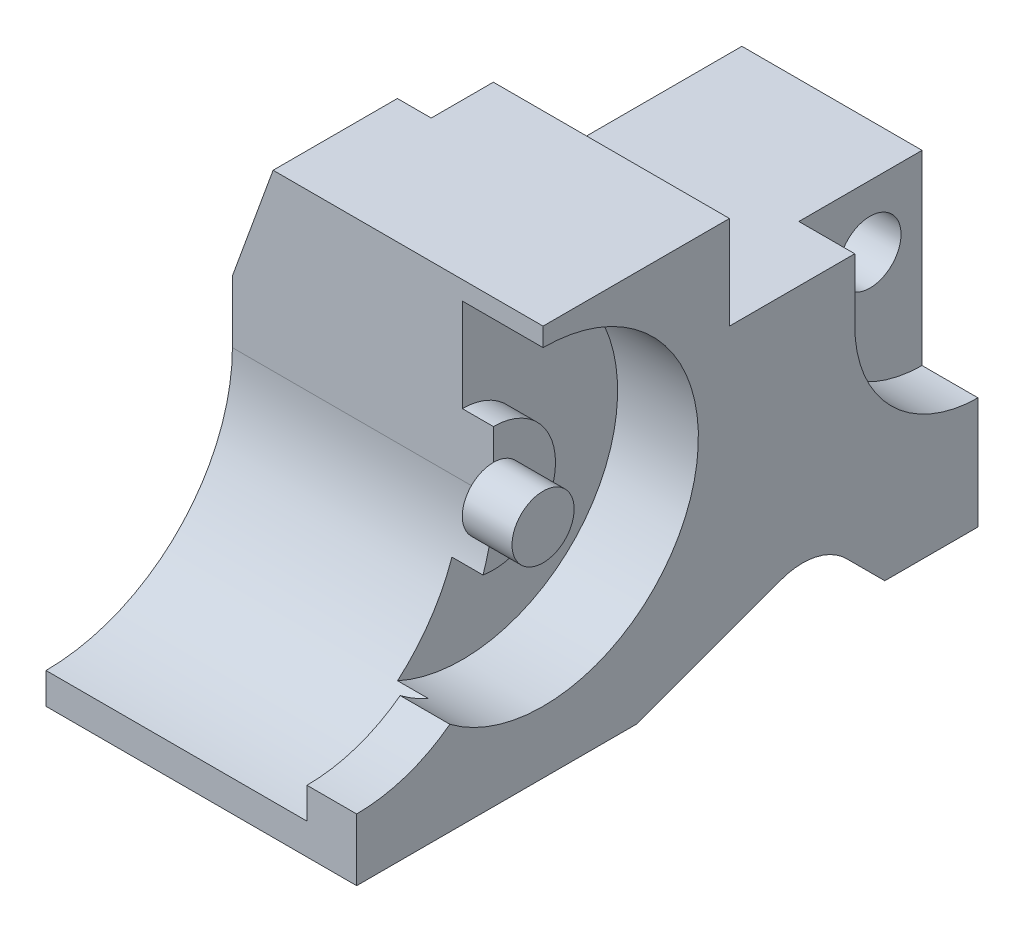
ISO-10303-21;
HEADER;
FILE_DESCRIPTION(('STEP AP214'),'2;1');
FILE_NAME('part.step','',(''),(''),'','','');
FILE_SCHEMA(('AUTOMOTIVE_DESIGN { 1 0 10303 214 1 1 1 1 }'));
ENDSEC;
DATA;
#1=APPLICATION_CONTEXT('core data for automotive mechanical design processes');
#2=APPLICATION_PROTOCOL_DEFINITION('international standard','automotive_design',2000,#1);
#3=PRODUCT_CONTEXT('',#1,'mechanical');
#4=PRODUCT('Part','Part','',(#3));
#5=PRODUCT_RELATED_PRODUCT_CATEGORY('part','',(#4));
#6=PRODUCT_DEFINITION_FORMATION('','',#4);
#7=PRODUCT_DEFINITION_CONTEXT('part definition',#1,'design');
#8=PRODUCT_DEFINITION('design','',#6,#7);
#9=PRODUCT_DEFINITION_SHAPE('','',#8);
#10=(LENGTH_UNIT() NAMED_UNIT(*) SI_UNIT(.MILLI.,.METRE.));
#11=(NAMED_UNIT(*) PLANE_ANGLE_UNIT() SI_UNIT($,.RADIAN.));
#12=(NAMED_UNIT(*) SI_UNIT($,.STERADIAN.) SOLID_ANGLE_UNIT());
#13=UNCERTAINTY_MEASURE_WITH_UNIT(LENGTH_MEASURE(1.E-05),#10,'distance_accuracy_value','');
#14=(GEOMETRIC_REPRESENTATION_CONTEXT(3) GLOBAL_UNCERTAINTY_ASSIGNED_CONTEXT((#13)) GLOBAL_UNIT_ASSIGNED_CONTEXT((#10,
#11,#12)) REPRESENTATION_CONTEXT('',''));
#15=CARTESIAN_POINT('',(0.,0.,0.));
#16=DIRECTION('',(0.,0.,1.));
#17=DIRECTION('',(1.,0.,0.));
#18=AXIS2_PLACEMENT_3D('',#15,#16,#17);
#19=CARTESIAN_POINT('',(-50.,37.748490945674,43.3502422988636));
#20=DIRECTION('',(0.,0.,1.));
#21=DIRECTION('',(1.,0.,0.));
#22=AXIS2_PLACEMENT_3D('',#19,#20,#21);
#23=PLANE('',#22);
#24=DIRECTION('',(0.,-1.,0.));
#25=VECTOR('',#24,1.);
#26=CARTESIAN_POINT('',(0.,37.748490945674,43.3502422988636));
#27=LINE('',#26,#25);
#28=CARTESIAN_POINT('',(0.,-15.2515090543259,43.3502422988636));
#29=VERTEX_POINT('',#28);
#30=CARTESIAN_POINT('',(0.,-25.2515090543259,43.3502422988636));
#31=VERTEX_POINT('',#30);
#32=EDGE_CURVE('E245',#29,#31,#27,.T.);
#33=ORIENTED_EDGE('',*,*,#32,.F.);
#34=DIRECTION('',(1.,0.,0.));
#35=VECTOR('',#34,1.);
#36=CARTESIAN_POINT('',(-37.1547594742265,-15.2515090543259,43.3502422988636));
#37=LINE('',#36,#35);
#38=CARTESIAN_POINT('',(-8.,-15.2515090543259,43.3502422988636));
#39=VERTEX_POINT('',#38);
#40=EDGE_CURVE('E391',#39,#29,#37,.T.);
#41=ORIENTED_EDGE('',*,*,#40,.F.);
#42=DIRECTION('',(0.,1.,0.));
#43=VECTOR('',#42,1.);
#44=CARTESIAN_POINT('',(-8.,0.,43.3502422988636));
#45=LINE('',#44,#43);
#46=CARTESIAN_POINT('',(-8.,-20.2515090543259,43.3502422988636));
#47=VERTEX_POINT('',#46);
#48=EDGE_CURVE('E319',#47,#39,#45,.T.);
#49=ORIENTED_EDGE('',*,*,#48,.F.);
#50=DIRECTION('',(-1.,0.,0.));
#51=VECTOR('',#50,1.);
#52=CARTESIAN_POINT('',(-8.,-20.2515090543259,43.3502422988636));
#53=LINE('',#52,#51);
#54=CARTESIAN_POINT('',(-50.,-20.2515090543259,43.3502422988636));
#55=VERTEX_POINT('',#54);
#56=EDGE_CURVE('E316',#47,#55,#53,.T.);
#57=ORIENTED_EDGE('',*,*,#56,.T.);
#58=DIRECTION('',(0.,-1.,0.));
#59=VECTOR('',#58,1.);
#60=CARTESIAN_POINT('',(-50.,37.748490945674,43.3502422988636));
#61=LINE('',#60,#59);
#62=CARTESIAN_POINT('',(-50.,-25.2515090543259,43.3502422988636));
#63=VERTEX_POINT('',#62);
#64=EDGE_CURVE('E239',#55,#63,#61,.T.);
#65=ORIENTED_EDGE('',*,*,#64,.T.);
#66=DIRECTION('',(1.,0.,0.));
#67=VECTOR('',#66,1.);
#68=CARTESIAN_POINT('',(-50.,-25.2515090543259,43.3502422988636));
#69=LINE('',#68,#67);
#70=EDGE_CURVE('E229',#63,#31,#69,.T.);
#71=ORIENTED_EDGE('',*,*,#70,.T.);
#72=EDGE_LOOP('',(#33,#41,#49,#57,#65,#71));
#73=FACE_BOUND('',#72,.T.);
#74=ADVANCED_FACE('F38',(#73),#23,.T.);
#75=CARTESIAN_POINT('',(0.,0.,0.));
#76=DIRECTION('',(1.,0.,0.));
#77=DIRECTION('',(0.,0.,-1.));
#78=AXIS2_PLACEMENT_3D('',#75,#76,#77);
#79=PLANE('',#78);
#80=CARTESIAN_POINT('',(0.,9.74849094567405,13.3502422988636));
#81=DIRECTION('',(1.,0.,0.));
#82=DIRECTION('',(0.,0.,-1.));
#83=AXIS2_PLACEMENT_3D('',#80,#81,#82);
#84=CIRCLE('',#83,25.);
#85=CARTESIAN_POINT('',(0.,-10.2515090543259,28.3502422988636));
#86=VERTEX_POINT('',#85);
#87=CARTESIAN_POINT('',(0.,34.7484909456741,13.3502422988636));
#88=VERTEX_POINT('',#87);
#89=EDGE_CURVE('E358',#86,#88,#84,.T.);
#90=ORIENTED_EDGE('',*,*,#89,.F.);
#91=CARTESIAN_POINT('',(0.,9.74849094567405,43.3502422988636));
#92=DIRECTION('',(1.,0.,0.));
#93=DIRECTION('',(0.,0.,-1.));
#94=AXIS2_PLACEMENT_3D('',#91,#92,#93);
#95=CIRCLE('',#94,25.);
#96=EDGE_CURVE('E52',#86,#29,#95,.F.);
#97=ORIENTED_EDGE('',*,*,#96,.T.);
#98=ORIENTED_EDGE('',*,*,#32,.T.);
#99=DIRECTION('',(0.,0.,-1.));
#100=VECTOR('',#99,1.);
#101=CARTESIAN_POINT('',(0.,-25.2515090543259,43.3502422988636));
#102=LINE('',#101,#100);
#103=CARTESIAN_POINT('',(0.,-25.2515090543259,-1.64975770113641));
#104=VERTEX_POINT('',#103);
#105=EDGE_CURVE('E241',#31,#104,#102,.T.);
#106=ORIENTED_EDGE('',*,*,#105,.T.);
#107=DIRECTION('',(0.,-0.342020143325663,0.93969262078591));
#108=VECTOR('',#107,1.);
#109=CARTESIAN_POINT('',(0.,-16.756570836525,-24.9894086342069));
#110=LINE('',#109,#108);
#111=CARTESIAN_POINT('',(0.,-16.756570836525,-24.9894086342069));
#112=VERTEX_POINT('',#111);
#113=EDGE_CURVE('E306',#112,#104,#110,.T.);
#114=ORIENTED_EDGE('',*,*,#113,.F.);
#115=CARTESIAN_POINT('',(0.,-26.1534970443841,-28.4096100674636));
#116=DIRECTION('',(1.,0.,0.));
#117=DIRECTION('',(0.,0.,-1.));
#118=AXIS2_PLACEMENT_3D('',#115,#116,#117);
#119=CIRCLE('',#118,10.);
#120=CARTESIAN_POINT('',(0.,-19.0824292325186,-35.480677879329));
#121=VERTEX_POINT('',#120);
#122=EDGE_CURVE('E308',#121,#112,#119,.T.);
#123=ORIENTED_EDGE('',*,*,#122,.F.);
#124=DIRECTION('',(0.,0.707106781186544,0.707106781186551));
#125=VECTOR('',#124,1.);
#126=CARTESIAN_POINT('',(0.,-25.2515090543259,-41.6497577011364));
#127=LINE('',#126,#125);
#128=CARTESIAN_POINT('',(0.,-25.2515090543259,-41.6497577011364));
#129=VERTEX_POINT('',#128);
#130=EDGE_CURVE('E311',#129,#121,#127,.T.);
#131=ORIENTED_EDGE('',*,*,#130,.F.);
#132=CARTESIAN_POINT('',(0.,-25.2515090543259,-56.6497577011364));
#133=VERTEX_POINT('',#132);
#134=EDGE_CURVE('E244',#129,#133,#102,.T.);
#135=ORIENTED_EDGE('',*,*,#134,.T.);
#136=DIRECTION('',(0.,1.,0.));
#137=VECTOR('',#136,1.);
#138=CARTESIAN_POINT('',(0.,37.748490945674,-56.6497577011364));
#139=LINE('',#138,#137);
#140=CARTESIAN_POINT('',(0.,-7.25083423659062,-56.6497577011364));
#141=VERTEX_POINT('',#140);
#142=EDGE_CURVE('E228',#133,#141,#139,.T.);
#143=ORIENTED_EDGE('',*,*,#142,.T.);
#144=CARTESIAN_POINT('',(0.,12.7484909456741,-56.8140508964729));
#145=DIRECTION('',(1.,0.,0.));
#146=DIRECTION('',(0.,0.,-1.));
#147=AXIS2_PLACEMENT_3D('',#144,#145,#146);
#148=CIRCLE('',#147,20.);
#149=CARTESIAN_POINT('',(0.,12.748490945674,-36.8140508964729));
#150=VERTEX_POINT('',#149);
#151=EDGE_CURVE('E279',#150,#141,#148,.T.);
#152=ORIENTED_EDGE('',*,*,#151,.F.);
#153=DIRECTION('',(0.,-1.,0.));
#154=VECTOR('',#153,1.);
#155=CARTESIAN_POINT('',(0.,22.748490945674,-36.8140508964729));
#156=LINE('',#155,#154);
#157=CARTESIAN_POINT('',(0.,22.748490945674,-36.8140508964729));
#158=VERTEX_POINT('',#157);
#159=EDGE_CURVE('E282',#158,#150,#156,.T.);
#160=ORIENTED_EDGE('',*,*,#159,.F.);
#161=DIRECTION('',(0.,0.,-1.));
#162=VECTOR('',#161,1.);
#163=CARTESIAN_POINT('',(0.,22.748490945674,-56.6497577011364));
#164=LINE('',#163,#162);
#165=CARTESIAN_POINT('',(0.,22.748490945674,-16.6497577011364));
#166=VERTEX_POINT('',#165);
#167=EDGE_CURVE('E259',#166,#158,#164,.T.);
#168=ORIENTED_EDGE('',*,*,#167,.F.);
#169=DIRECTION('',(0.,1.,0.));
#170=VECTOR('',#169,1.);
#171=CARTESIAN_POINT('',(0.,22.748490945674,-16.6497577011364));
#172=LINE('',#171,#170);
#173=CARTESIAN_POINT('',(0.,37.748490945674,-16.6497577011364));
#174=VERTEX_POINT('',#173);
#175=EDGE_CURVE('E247',#166,#174,#172,.T.);
#176=ORIENTED_EDGE('',*,*,#175,.T.);
#177=DIRECTION('',(0.,0.,1.));
#178=VECTOR('',#177,1.);
#179=CARTESIAN_POINT('',(0.,37.748490945674,43.3502422988636));
#180=LINE('',#179,#178);
#181=CARTESIAN_POINT('',(0.,37.748490945674,13.3502422988636));
#182=VERTEX_POINT('',#181);
#183=EDGE_CURVE('E236',#174,#182,#180,.T.);
#184=ORIENTED_EDGE('',*,*,#183,.T.);
#185=DIRECTION('',(0.,1.,0.));
#186=VECTOR('',#185,1.);
#187=CARTESIAN_POINT('',(0.,0.,13.3502422988636));
#188=LINE('',#187,#186);
#189=EDGE_CURVE('E335',#88,#182,#188,.T.);
#190=ORIENTED_EDGE('',*,*,#189,.F.);
#191=EDGE_LOOP('',(#90,#97,#98,#106,#114,#123,#131,#135,#143,#152,#160,#168,#176,#184,#190));
#192=FACE_BOUND('',#191,.T.);
#193=ADVANCED_FACE('F429',(#192),#79,.T.);
#194=CARTESIAN_POINT('',(-8.,0.,0.));
#195=DIRECTION('',(-1.,0.,0.));
#196=DIRECTION('',(0.,0.,1.));
#197=AXIS2_PLACEMENT_3D('',#194,#195,#196);
#198=PLANE('',#197);
#199=ORIENTED_EDGE('',*,*,#48,.T.);
#200=CARTESIAN_POINT('',(-8.,9.74849094567405,43.3502422988636));
#201=DIRECTION('',(-1.,0.,0.));
#202=DIRECTION('',(0.,0.,1.));
#203=AXIS2_PLACEMENT_3D('',#200,#201,#202);
#204=CIRCLE('',#203,25.);
#205=CARTESIAN_POINT('',(-8.,-10.2515090543259,28.3502422988636));
#206=VERTEX_POINT('',#205);
#207=EDGE_CURVE('E387',#206,#39,#204,.T.);
#208=ORIENTED_EDGE('',*,*,#207,.F.);
#209=CARTESIAN_POINT('',(-8.,9.74849094567405,13.3502422988636));
#210=DIRECTION('',(-1.,0.,0.));
#211=DIRECTION('',(0.,0.,1.));
#212=AXIS2_PLACEMENT_3D('',#209,#210,#211);
#213=CIRCLE('',#212,25.);
#214=CARTESIAN_POINT('',(-8.,-12.9779926264837,23.7669089655303));
#215=VERTEX_POINT('',#214);
#216=EDGE_CURVE('E345',#215,#206,#213,.T.);
#217=ORIENTED_EDGE('',*,*,#216,.F.);
#218=CARTESIAN_POINT('',(-8.,9.74849094567405,43.3502422988636));
#219=DIRECTION('',(-1.,0.,0.));
#220=DIRECTION('',(0.,0.,1.));
#221=AXIS2_PLACEMENT_3D('',#218,#219,#220);
#222=CIRCLE('',#221,30.);
#223=EDGE_CURVE('E329',#47,#215,#222,.F.);
#224=ORIENTED_EDGE('',*,*,#223,.F.);
#225=EDGE_LOOP('',(#199,#208,#217,#224));
#226=FACE_BOUND('',#225,.T.);
#227=ADVANCED_FACE('F458',(#226),#198,.T.);
#228=CARTESIAN_POINT('',(-13.,9.74849094567405,13.3502422988636));
#229=DIRECTION('',(1.,0.,0.));
#230=DIRECTION('',(0.,0.,-1.));
#231=AXIS2_PLACEMENT_3D('',#228,#229,#230);
#232=CYLINDRICAL_SURFACE('',#231,25.);
#233=DIRECTION('',(1.,0.,0.));
#234=VECTOR('',#233,1.);
#235=CARTESIAN_POINT('',(-37.1547594742265,-10.2515090543259,28.3502422988636));
#236=LINE('',#235,#234);
#237=EDGE_CURVE('E388',#206,#86,#236,.T.);
#238=ORIENTED_EDGE('',*,*,#237,.T.);
#239=ORIENTED_EDGE('',*,*,#89,.T.);
#240=DIRECTION('',(1.,0.,0.));
#241=VECTOR('',#240,1.);
#242=CARTESIAN_POINT('',(-13.,34.7484909456741,13.3502422988636));
#243=LINE('',#242,#241);
#244=CARTESIAN_POINT('',(-13.,34.7484909456741,13.3502422988636));
#245=VERTEX_POINT('',#244);
#246=EDGE_CURVE('E352',#245,#88,#243,.T.);
#247=ORIENTED_EDGE('',*,*,#246,.F.);
#248=CARTESIAN_POINT('',(-13.,9.74849094567405,13.3502422988636));
#249=DIRECTION('',(1.,0.,0.));
#250=DIRECTION('',(0.,0.,-1.));
#251=AXIS2_PLACEMENT_3D('',#248,#249,#250);
#252=CIRCLE('',#251,25.);
#253=CARTESIAN_POINT('',(-13.,-12.9779926264837,23.7669089655303));
#254=VERTEX_POINT('',#253);
#255=EDGE_CURVE('E364',#254,#245,#252,.T.);
#256=ORIENTED_EDGE('',*,*,#255,.F.);
#257=DIRECTION('',(1.,0.,0.));
#258=VECTOR('',#257,1.);
#259=CARTESIAN_POINT('',(-6.5,-12.9779926264837,23.7669089655303));
#260=LINE('',#259,#258);
#261=EDGE_CURVE('E343',#254,#215,#260,.T.);
#262=ORIENTED_EDGE('',*,*,#261,.T.);
#263=ORIENTED_EDGE('',*,*,#216,.T.);
#264=EDGE_LOOP('',(#238,#239,#247,#256,#262,#263));
#265=FACE_BOUND('',#264,.T.);
#266=ADVANCED_FACE('F461',(#265),#232,.F.);
#267=CARTESIAN_POINT('',(0.,0.,13.3502422988636));
#268=DIRECTION('',(0.,0.,1.));
#269=DIRECTION('',(1.,0.,0.));
#270=AXIS2_PLACEMENT_3D('',#267,#268,#269);
#271=PLANE('',#270);
#272=DIRECTION('',(0.342020143325669,0.939692620785908,0.));
#273=VECTOR('',#272,1.);
#274=CARTESIAN_POINT('',(-50.,19.748490945674,13.3502422988636));
#275=LINE('',#274,#273);
#276=CARTESIAN_POINT('',(-50.,19.748490945674,13.3502422988636));
#277=VERTEX_POINT('',#276);
#278=CARTESIAN_POINT('',(-43.4485357832083,37.748490945674,13.3502422988636));
#279=VERTEX_POINT('',#278);
#280=EDGE_CURVE('E384',#277,#279,#275,.T.);
#281=ORIENTED_EDGE('',*,*,#280,.F.);
#282=DIRECTION('',(0.,1.,0.));
#283=VECTOR('',#282,1.);
#284=CARTESIAN_POINT('',(-50.,0.,13.3502422988636));
#285=LINE('',#284,#283);
#286=CARTESIAN_POINT('',(-50.,9.74849094567405,13.3502422988636));
#287=VERTEX_POINT('',#286);
#288=EDGE_CURVE('E336',#287,#277,#285,.T.);
#289=ORIENTED_EDGE('',*,*,#288,.F.);
#290=DIRECTION('',(-1.,0.,0.));
#291=VECTOR('',#290,1.);
#292=CARTESIAN_POINT('',(-8.,9.74849094567405,13.3502422988636));
#293=LINE('',#292,#291);
#294=CARTESIAN_POINT('',(-8.,9.74849094567405,13.3502422988636));
#295=VERTEX_POINT('',#294);
#296=EDGE_CURVE('E314',#295,#287,#293,.T.);
#297=ORIENTED_EDGE('',*,*,#296,.F.);
#298=DIRECTION('',(0.,-1.,0.));
#299=VECTOR('',#298,1.);
#300=CARTESIAN_POINT('',(-8.,0.,13.3502422988636));
#301=LINE('',#300,#299);
#302=CARTESIAN_POINT('',(-8.,14.7484909456741,13.3502422988636));
#303=VERTEX_POINT('',#302);
#304=EDGE_CURVE('E372',#303,#295,#301,.T.);
#305=ORIENTED_EDGE('',*,*,#304,.F.);
#306=DIRECTION('',(0.,-1.,0.));
#307=VECTOR('',#306,1.);
#308=CARTESIAN_POINT('',(-8.,0.,13.3502422988636));
#309=LINE('',#308,#307);
#310=CARTESIAN_POINT('',(-8.,19.7484909456741,13.3502422988636));
#311=VERTEX_POINT('',#310);
#312=EDGE_CURVE('E361',#311,#303,#309,.T.);
#313=ORIENTED_EDGE('',*,*,#312,.F.);
#314=DIRECTION('',(1.,0.,0.));
#315=VECTOR('',#314,1.);
#316=CARTESIAN_POINT('',(-13.,19.7484909456741,13.3502422988636));
#317=LINE('',#316,#315);
#318=CARTESIAN_POINT('',(-13.,19.7484909456741,13.3502422988636));
#319=VERTEX_POINT('',#318);
#320=EDGE_CURVE('E351',#319,#311,#317,.T.);
#321=ORIENTED_EDGE('',*,*,#320,.F.);
#322=DIRECTION('',(0.,-1.,0.));
#323=VECTOR('',#322,1.);
#324=CARTESIAN_POINT('',(-13.,0.,13.3502422988636));
#325=LINE('',#324,#323);
#326=EDGE_CURVE('E355',#245,#319,#325,.T.);
#327=ORIENTED_EDGE('',*,*,#326,.F.);
#328=ORIENTED_EDGE('',*,*,#246,.T.);
#329=ORIENTED_EDGE('',*,*,#189,.T.);
#330=DIRECTION('',(-1.,0.,0.));
#331=VECTOR('',#330,1.);
#332=CARTESIAN_POINT('',(0.,37.748490945674,13.3502422988636));
#333=LINE('',#332,#331);
#334=EDGE_CURVE('E326',#182,#279,#333,.T.);
#335=ORIENTED_EDGE('',*,*,#334,.T.);
#336=EDGE_LOOP('',(#281,#289,#297,#305,#313,#321,#327,#328,#329,#335));
#337=FACE_BOUND('',#336,.T.);
#338=ADVANCED_FACE('F419',(#337),#271,.T.);
#339=CARTESIAN_POINT('',(0.,9.74849094567405,13.3502422988636));
#340=DIRECTION('',(1.,0.,0.));
#341=DIRECTION('',(0.,0.,-1.));
#342=AXIS2_PLACEMENT_3D('',#339,#340,#341);
#343=CIRCLE('',#342,5.);
#344=CARTESIAN_POINT('',(0.,9.74849094567405,8.35024229886359));
#345=VERTEX_POINT('',#344);
#346=EDGE_CURVE('E368',#345,#345,#343,.T.);
#347=ORIENTED_EDGE('',*,*,#346,.T.);
#348=EDGE_LOOP('',(#347));
#349=FACE_BOUND('',#348,.T.);
#350=ADVANCED_FACE('F482',(#349),#79,.T.);
#351=CARTESIAN_POINT('',(-8.,4.76588230271514,13.7669089655303));
#352=VERTEX_POINT('',#351);
#353=EDGE_CURVE('E325',#352,#295,#222,.F.);
#354=ORIENTED_EDGE('',*,*,#353,.F.);
#355=CARTESIAN_POINT('',(-8.,9.74849094567405,13.3502422988636));
#356=DIRECTION('',(1.,0.,0.));
#357=DIRECTION('',(0.,0.,-1.));
#358=AXIS2_PLACEMENT_3D('',#355,#356,#357);
#359=CIRCLE('',#358,5.);
#360=EDGE_CURVE('E375',#303,#352,#359,.T.);
#361=ORIENTED_EDGE('',*,*,#360,.F.);
#362=ORIENTED_EDGE('',*,*,#304,.T.);
#363=EDGE_LOOP('',(#354,#361,#362));
#364=FACE_BOUND('',#363,.T.);
#365=ADVANCED_FACE('F480',(#364),#198,.T.);
#366=CARTESIAN_POINT('',(-13.,9.74849094567405,13.3502422988636));
#367=DIRECTION('',(1.,0.,0.));
#368=DIRECTION('',(0.,0.,-1.));
#369=AXIS2_PLACEMENT_3D('',#366,#367,#368);
#370=CYLINDRICAL_SURFACE('',#369,10.);
#371=ORIENTED_EDGE('',*,*,#320,.T.);
#372=CARTESIAN_POINT('',(-8.,9.74849094567405,13.3502422988636));
#373=DIRECTION('',(1.,0.,0.));
#374=DIRECTION('',(0.,0.,-1.));
#375=AXIS2_PLACEMENT_3D('',#372,#373,#374);
#376=CIRCLE('',#375,10.);
#377=CARTESIAN_POINT('',(-8.,-0.11164202615864,15.0169089655303));
#378=VERTEX_POINT('',#377);
#379=EDGE_CURVE('E45',#311,#378,#376,.F.);
#380=ORIENTED_EDGE('',*,*,#379,.T.);
#381=DIRECTION('',(1.,0.,0.));
#382=VECTOR('',#381,1.);
#383=CARTESIAN_POINT('',(-6.5,-0.111642026158643,15.0169089655303));
#384=LINE('',#383,#382);
#385=CARTESIAN_POINT('',(-13.,-0.111642026158642,15.0169089655303));
#386=VERTEX_POINT('',#385);
#387=EDGE_CURVE('E339',#386,#378,#384,.T.);
#388=ORIENTED_EDGE('',*,*,#387,.F.);
#389=CARTESIAN_POINT('',(-13.,9.74849094567405,13.3502422988636));
#390=DIRECTION('',(1.,0.,0.));
#391=DIRECTION('',(0.,0.,-1.));
#392=AXIS2_PLACEMENT_3D('',#389,#390,#391);
#393=CIRCLE('',#392,10.);
#394=EDGE_CURVE('E360',#386,#319,#393,.T.);
#395=ORIENTED_EDGE('',*,*,#394,.T.);
#396=EDGE_LOOP('',(#371,#380,#388,#395));
#397=FACE_BOUND('',#396,.T.);
#398=ADVANCED_FACE('F470',(#397),#370,.T.);
#399=CARTESIAN_POINT('',(-8.,9.74849094567405,43.3502422988636));
#400=DIRECTION('',(-1.,0.,0.));
#401=DIRECTION('',(0.,0.,1.));
#402=AXIS2_PLACEMENT_3D('',#399,#400,#401);
#403=CYLINDRICAL_SURFACE('',#402,30.);
#404=CARTESIAN_POINT('',(-13.,9.74849094567405,43.3502422988636));
#405=DIRECTION('',(1.,0.,0.));
#406=DIRECTION('',(0.,0.,-1.));
#407=AXIS2_PLACEMENT_3D('',#404,#405,#406);
#408=CIRCLE('',#407,30.);
#409=EDGE_CURVE('E348',#254,#386,#408,.T.);
#410=ORIENTED_EDGE('',*,*,#409,.T.);
#411=ORIENTED_EDGE('',*,*,#387,.T.);
#412=EDGE_CURVE('E332',#378,#352,#222,.F.);
#413=ORIENTED_EDGE('',*,*,#412,.T.);
#414=ORIENTED_EDGE('',*,*,#353,.T.);
#415=ORIENTED_EDGE('',*,*,#296,.T.);
#416=CARTESIAN_POINT('',(-50.,9.74849094567405,43.3502422988636));
#417=DIRECTION('',(-1.,0.,0.));
#418=DIRECTION('',(0.,0.,1.));
#419=AXIS2_PLACEMENT_3D('',#416,#417,#418);
#420=CIRCLE('',#419,30.);
#421=EDGE_CURVE('E322',#55,#287,#420,.F.);
#422=ORIENTED_EDGE('',*,*,#421,.F.);
#423=ORIENTED_EDGE('',*,*,#56,.F.);
#424=ORIENTED_EDGE('',*,*,#223,.T.);
#425=ORIENTED_EDGE('',*,*,#261,.F.);
#426=EDGE_LOOP('',(#410,#411,#413,#414,#415,#422,#423,#424,#425));
#427=FACE_BOUND('',#426,.T.);
#428=ADVANCED_FACE('F454',(#427),#403,.F.);
#429=CARTESIAN_POINT('',(-50.,0.,0.));
#430=DIRECTION('',(1.,0.,0.));
#431=DIRECTION('',(0.,0.,-1.));
#432=AXIS2_PLACEMENT_3D('',#429,#430,#431);
#433=PLANE('',#432);
#434=DIRECTION('',(0.,0.,1.));
#435=VECTOR('',#434,1.);
#436=CARTESIAN_POINT('',(-50.,19.748490945674,-25.8049576057028));
#437=LINE('',#436,#435);
#438=CARTESIAN_POINT('',(-50.,19.748490945674,-6.64975770113641));
#439=VERTEX_POINT('',#438);
#440=EDGE_CURVE('E382',#439,#277,#437,.T.);
#441=ORIENTED_EDGE('',*,*,#440,.F.);
#442=DIRECTION('',(0.,1.,0.));
#443=VECTOR('',#442,1.);
#444=CARTESIAN_POINT('',(-50.,-25.251509054326,-6.64975770113641));
#445=LINE('',#444,#443);
#446=CARTESIAN_POINT('',(-50.,-23.431657882995,-6.64975770113641));
#447=VERTEX_POINT('',#446);
#448=EDGE_CURVE('E214',#447,#439,#445,.T.);
#449=ORIENTED_EDGE('',*,*,#448,.F.);
#450=DIRECTION('',(0.,-0.342020143325663,0.93969262078591));
#451=VECTOR('',#450,1.);
#452=CARTESIAN_POINT('',(-50.,-16.756570836525,-24.9894086342069));
#453=LINE('',#452,#451);
#454=CARTESIAN_POINT('',(-50.,-25.2515090543259,-1.64975770113641));
#455=VERTEX_POINT('',#454);
#456=EDGE_CURVE('E300',#447,#455,#453,.T.);
#457=ORIENTED_EDGE('',*,*,#456,.T.);
#458=DIRECTION('',(0.,0.,-1.));
#459=VECTOR('',#458,1.);
#460=CARTESIAN_POINT('',(-50.,-25.2515090543259,43.3502422988636));
#461=LINE('',#460,#459);
#462=EDGE_CURVE('E233',#63,#455,#461,.T.);
#463=ORIENTED_EDGE('',*,*,#462,.F.);
#464=ORIENTED_EDGE('',*,*,#64,.F.);
#465=ORIENTED_EDGE('',*,*,#421,.T.);
#466=ORIENTED_EDGE('',*,*,#288,.T.);
#467=EDGE_LOOP('',(#441,#449,#457,#463,#464,#465,#466));
#468=FACE_BOUND('',#467,.T.);
#469=ADVANCED_FACE('F415',(#468),#433,.F.);
#470=CARTESIAN_POINT('',(-50.,37.748490945674,43.3502422988636));
#471=DIRECTION('',(0.,1.,0.));
#472=DIRECTION('',(0.,0.,1.));
#473=AXIS2_PLACEMENT_3D('',#470,#471,#472);
#474=PLANE('',#473);
#475=DIRECTION('',(0.,0.,1.));
#476=VECTOR('',#475,1.);
#477=CARTESIAN_POINT('',(-43.4485357832083,37.748490945674,-25.8049576057028));
#478=LINE('',#477,#476);
#479=CARTESIAN_POINT('',(-43.4485357832084,37.748490945674,-6.64975770113641));
#480=VERTEX_POINT('',#479);
#481=EDGE_CURVE('E60',#480,#279,#478,.T.);
#482=ORIENTED_EDGE('',*,*,#481,.T.);
#483=ORIENTED_EDGE('',*,*,#334,.F.);
#484=ORIENTED_EDGE('',*,*,#183,.F.);
#485=DIRECTION('',(1.,0.,0.));
#486=VECTOR('',#485,1.);
#487=CARTESIAN_POINT('',(-50.,37.748490945674,-16.6497577011364));
#488=LINE('',#487,#486);
#489=CARTESIAN_POINT('',(-38.,37.748490945674,-16.6497577011364));
#490=VERTEX_POINT('',#489);
#491=EDGE_CURVE('E254',#490,#174,#488,.T.);
#492=ORIENTED_EDGE('',*,*,#491,.F.);
#493=DIRECTION('',(0.,0.,-1.));
#494=VECTOR('',#493,1.);
#495=CARTESIAN_POINT('',(-38.,37.748490945674,-16.6497577011364));
#496=LINE('',#495,#494);
#497=CARTESIAN_POINT('',(-38.,37.748490945674,-6.64975770113641));
#498=VERTEX_POINT('',#497);
#499=EDGE_CURVE('E266',#498,#490,#496,.T.);
#500=ORIENTED_EDGE('',*,*,#499,.F.);
#501=DIRECTION('',(1.,0.,0.));
#502=VECTOR('',#501,1.);
#503=CARTESIAN_POINT('',(-50.,37.748490945674,-6.64975770113641));
#504=LINE('',#503,#502);
#505=EDGE_CURVE('E270',#480,#498,#504,.T.);
#506=ORIENTED_EDGE('',*,*,#505,.F.);
#507=EDGE_LOOP('',(#482,#483,#484,#492,#500,#506));
#508=FACE_BOUND('',#507,.T.);
#509=ADVANCED_FACE('F425',(#508),#474,.T.);
#510=CARTESIAN_POINT('',(-50.,-25.2515090543259,43.3502422988636));
#511=DIRECTION('',(0.,-1.,0.));
#512=DIRECTION('',(0.,0.,-1.));
#513=AXIS2_PLACEMENT_3D('',#510,#511,#512);
#514=PLANE('',#513);
#515=DIRECTION('',(1.,0.,0.));
#516=VECTOR('',#515,1.);
#517=CARTESIAN_POINT('',(-50.,-25.2515090543259,-1.64975770113641));
#518=LINE('',#517,#516);
#519=EDGE_CURVE('E297',#455,#104,#518,.T.);
#520=ORIENTED_EDGE('',*,*,#519,.T.);
#521=ORIENTED_EDGE('',*,*,#105,.F.);
#522=ORIENTED_EDGE('',*,*,#70,.F.);
#523=ORIENTED_EDGE('',*,*,#462,.T.);
#524=EDGE_LOOP('',(#520,#521,#522,#523));
#525=FACE_BOUND('',#524,.T.);
#526=ADVANCED_FACE('F446',(#525),#514,.T.);
#527=CARTESIAN_POINT('',(-50.,37.748490945674,-56.6497577011364));
#528=DIRECTION('',(0.,0.,-1.));
#529=DIRECTION('',(0.,1.,0.));
#530=AXIS2_PLACEMENT_3D('',#527,#528,#529);
#531=PLANE('',#530);
#532=DIRECTION('',(0.,1.,0.));
#533=VECTOR('',#532,1.);
#534=CARTESIAN_POINT('',(-38.,-25.251509054326,-56.6497577011364));
#535=LINE('',#534,#533);
#536=CARTESIAN_POINT('',(-38.,-25.251509054326,-56.6497577011364));
#537=VERTEX_POINT('',#536);
#538=CARTESIAN_POINT('',(-38.,22.748490945674,-56.6497577011364));
#539=VERTEX_POINT('',#538);
#540=EDGE_CURVE('E203',#537,#539,#535,.T.);
#541=ORIENTED_EDGE('',*,*,#540,.T.);
#542=DIRECTION('',(-1.,0.,0.));
#543=VECTOR('',#542,1.);
#544=CARTESIAN_POINT('',(-50.,22.748490945674,-56.6497577011364));
#545=LINE('',#544,#543);
#546=CARTESIAN_POINT('',(-9.,22.748490945674,-56.6497577011364));
#547=VERTEX_POINT('',#546);
#548=EDGE_CURVE('E253',#547,#539,#545,.T.);
#549=ORIENTED_EDGE('',*,*,#548,.F.);
#550=DIRECTION('',(0.,1.,0.));
#551=VECTOR('',#550,1.);
#552=CARTESIAN_POINT('',(-9.,22.748490945674,-56.6497577011364));
#553=LINE('',#552,#551);
#554=CARTESIAN_POINT('',(-9.,-7.25083423659062,-56.6497577011364));
#555=VERTEX_POINT('',#554);
#556=EDGE_CURVE('E276',#555,#547,#553,.T.);
#557=ORIENTED_EDGE('',*,*,#556,.F.);
#558=DIRECTION('',(1.,0.,0.));
#559=VECTOR('',#558,1.);
#560=CARTESIAN_POINT('',(-9.,-7.25083423659062,-56.6497577011364));
#561=LINE('',#560,#559);
#562=EDGE_CURVE('E272',#555,#141,#561,.T.);
#563=ORIENTED_EDGE('',*,*,#562,.T.);
#564=ORIENTED_EDGE('',*,*,#142,.F.);
#565=DIRECTION('',(1.,0.,0.));
#566=VECTOR('',#565,1.);
#567=CARTESIAN_POINT('',(-50.,-25.2515090543259,-56.6497577011364));
#568=LINE('',#567,#566);
#569=EDGE_CURVE('E220',#537,#133,#568,.T.);
#570=ORIENTED_EDGE('',*,*,#569,.F.);
#571=EDGE_LOOP('',(#541,#549,#557,#563,#564,#570));
#572=FACE_BOUND('',#571,.T.);
#573=ADVANCED_FACE('F225',(#572),#531,.T.);
#574=DIRECTION('',(0.,0.,-1.));
#575=VECTOR('',#574,1.);
#576=CARTESIAN_POINT('',(-38.,-25.251509054326,-6.64975770113641));
#577=LINE('',#576,#575);
#578=CARTESIAN_POINT('',(-38.,-25.251509054326,-41.6497577011364));
#579=VERTEX_POINT('',#578);
#580=EDGE_CURVE('E207',#579,#537,#577,.T.);
#581=ORIENTED_EDGE('',*,*,#580,.T.);
#582=ORIENTED_EDGE('',*,*,#569,.T.);
#583=ORIENTED_EDGE('',*,*,#134,.F.);
#584=DIRECTION('',(1.,0.,0.));
#585=VECTOR('',#584,1.);
#586=CARTESIAN_POINT('',(-50.,-25.2515090543259,-41.6497577011364));
#587=LINE('',#586,#585);
#588=EDGE_CURVE('E222',#579,#129,#587,.T.);
#589=ORIENTED_EDGE('',*,*,#588,.F.);
#590=EDGE_LOOP('',(#581,#582,#583,#589));
#591=FACE_BOUND('',#590,.T.);
#592=ADVANCED_FACE('F218',(#591),#514,.T.);
#593=CARTESIAN_POINT('',(-50.,22.748490945674,-16.6497577011364));
#594=DIRECTION('',(0.,0.,1.));
#595=DIRECTION('',(1.,0.,0.));
#596=AXIS2_PLACEMENT_3D('',#593,#594,#595);
#597=PLANE('',#596);
#598=DIRECTION('',(1.,0.,0.));
#599=VECTOR('',#598,1.);
#600=CARTESIAN_POINT('',(-50.,22.748490945674,-16.6497577011364));
#601=LINE('',#600,#599);
#602=CARTESIAN_POINT('',(-38.,22.748490945674,-16.6497577011364));
#603=VERTEX_POINT('',#602);
#604=EDGE_CURVE('E256',#603,#166,#601,.T.);
#605=ORIENTED_EDGE('',*,*,#604,.F.);
#606=DIRECTION('',(0.,1.,0.));
#607=VECTOR('',#606,1.);
#608=CARTESIAN_POINT('',(-38.,22.748490945674,-16.6497577011364));
#609=LINE('',#608,#607);
#610=EDGE_CURVE('E257',#603,#490,#609,.T.);
#611=ORIENTED_EDGE('',*,*,#610,.T.);
#612=ORIENTED_EDGE('',*,*,#491,.T.);
#613=ORIENTED_EDGE('',*,*,#175,.F.);
#614=EDGE_LOOP('',(#605,#611,#612,#613));
#615=FACE_BOUND('',#614,.T.);
#616=ADVANCED_FACE('F435',(#615),#597,.F.);
#617=CARTESIAN_POINT('',(0.,22.748490945674,0.));
#618=DIRECTION('',(0.,1.,0.));
#619=DIRECTION('',(0.,0.,1.));
#620=AXIS2_PLACEMENT_3D('',#617,#618,#619);
#621=PLANE('',#620);
#622=DIRECTION('',(0.,0.,-1.));
#623=VECTOR('',#622,1.);
#624=CARTESIAN_POINT('',(-38.,22.748490945674,-6.64975770113641));
#625=LINE('',#624,#623);
#626=EDGE_CURVE('E209',#603,#539,#625,.T.);
#627=ORIENTED_EDGE('',*,*,#626,.F.);
#628=ORIENTED_EDGE('',*,*,#604,.T.);
#629=ORIENTED_EDGE('',*,*,#167,.T.);
#630=DIRECTION('',(1.,0.,0.));
#631=VECTOR('',#630,1.);
#632=CARTESIAN_POINT('',(-9.,22.748490945674,-36.8140508964729));
#633=LINE('',#632,#631);
#634=CARTESIAN_POINT('',(-9.,22.748490945674,-36.8140508964729));
#635=VERTEX_POINT('',#634);
#636=EDGE_CURVE('E273',#635,#158,#633,.T.);
#637=ORIENTED_EDGE('',*,*,#636,.F.);
#638=DIRECTION('',(0.,0.,1.));
#639=VECTOR('',#638,1.);
#640=CARTESIAN_POINT('',(-9.,22.748490945674,-36.8140508964729));
#641=LINE('',#640,#639);
#642=EDGE_CURVE('E281',#547,#635,#641,.T.);
#643=ORIENTED_EDGE('',*,*,#642,.F.);
#644=ORIENTED_EDGE('',*,*,#548,.T.);
#645=EDGE_LOOP('',(#627,#628,#629,#637,#643,#644));
#646=FACE_BOUND('',#645,.T.);
#647=ADVANCED_FACE('F510',(#646),#621,.T.);
#648=CARTESIAN_POINT('',(-38.,22.748490945674,-16.6497577011364));
#649=DIRECTION('',(1.,0.,0.));
#650=DIRECTION('',(0.,0.,-1.));
#651=AXIS2_PLACEMENT_3D('',#648,#649,#650);
#652=PLANE('',#651);
#653=ORIENTED_EDGE('',*,*,#499,.T.);
#654=ORIENTED_EDGE('',*,*,#610,.F.);
#655=ORIENTED_EDGE('',*,*,#626,.T.);
#656=ORIENTED_EDGE('',*,*,#540,.F.);
#657=ORIENTED_EDGE('',*,*,#580,.F.);
#658=DIRECTION('',(0.,-0.707106781186544,-0.707106781186551));
#659=VECTOR('',#658,1.);
#660=CARTESIAN_POINT('',(-38.,-25.2515090543259,-41.6497577011364));
#661=LINE('',#660,#659);
#662=CARTESIAN_POINT('',(-38.,-19.0824292325186,-35.480677879329));
#663=VERTEX_POINT('',#662);
#664=EDGE_CURVE('E11',#663,#579,#661,.T.);
#665=ORIENTED_EDGE('',*,*,#664,.F.);
#666=CARTESIAN_POINT('',(-38.,-26.1534970443841,-28.4096100674636));
#667=DIRECTION('',(1.,0.,0.));
#668=DIRECTION('',(0.,0.,-1.));
#669=AXIS2_PLACEMENT_3D('',#666,#667,#668);
#670=CIRCLE('',#669,10.);
#671=CARTESIAN_POINT('',(-38.,-16.756570836525,-24.9894086342069));
#672=VERTEX_POINT('',#671);
#673=EDGE_CURVE('E400',#672,#663,#670,.F.);
#674=ORIENTED_EDGE('',*,*,#673,.F.);
#675=DIRECTION('',(0.,0.342020143325663,-0.939692620785911));
#676=VECTOR('',#675,1.);
#677=CARTESIAN_POINT('',(-38.,-16.756570836525,-24.9894086342069));
#678=LINE('',#677,#676);
#679=CARTESIAN_POINT('',(-38.,-23.431657882995,-6.64975770113641));
#680=VERTEX_POINT('',#679);
#681=EDGE_CURVE('E397',#680,#672,#678,.T.);
#682=ORIENTED_EDGE('',*,*,#681,.F.);
#683=DIRECTION('',(0.,1.,0.));
#684=VECTOR('',#683,1.);
#685=CARTESIAN_POINT('',(-38.,22.748490945674,-6.64975770113641));
#686=LINE('',#685,#684);
#687=EDGE_CURVE('E263',#680,#498,#686,.T.);
#688=ORIENTED_EDGE('',*,*,#687,.T.);
#689=EDGE_LOOP('',(#653,#654,#655,#656,#657,#665,#674,#682,#688));
#690=FACE_BOUND('',#689,.T.);
#691=CARTESIAN_POINT('',(-38.,12.748490945674,-48.2591123463616));
#692=DIRECTION('',(1.,0.,0.));
#693=DIRECTION('',(0.,0.,-1.));
#694=AXIS2_PLACEMENT_3D('',#691,#692,#693);
#695=CIRCLE('',#694,5.);
#696=CARTESIAN_POINT('',(-38.,12.748490945674,-53.2591123463616));
#697=VERTEX_POINT('',#696);
#698=EDGE_CURVE('E390',#697,#697,#695,.F.);
#699=ORIENTED_EDGE('',*,*,#698,.F.);
#700=EDGE_LOOP('',(#699));
#701=FACE_BOUND('',#700,.T.);
#702=ADVANCED_FACE('F205',(#690,#701),#652,.F.);
#703=CARTESIAN_POINT('',(-50.,22.748490945674,-6.64975770113641));
#704=DIRECTION('',(0.,0.,1.));
#705=DIRECTION('',(1.,0.,0.));
#706=AXIS2_PLACEMENT_3D('',#703,#704,#705);
#707=PLANE('',#706);
#708=ORIENTED_EDGE('',*,*,#687,.F.);
#709=DIRECTION('',(1.,0.,0.));
#710=VECTOR('',#709,1.);
#711=CARTESIAN_POINT('',(-50.,-23.431657882995,-6.64975770113641));
#712=LINE('',#711,#710);
#713=EDGE_CURVE('E403',#447,#680,#712,.T.);
#714=ORIENTED_EDGE('',*,*,#713,.F.);
#715=ORIENTED_EDGE('',*,*,#448,.T.);
#716=DIRECTION('',(-0.342020143325669,-0.939692620785908,0.));
#717=VECTOR('',#716,1.);
#718=CARTESIAN_POINT('',(-50.,19.748490945674,-6.64975770113641));
#719=LINE('',#718,#717);
#720=EDGE_CURVE('E380',#480,#439,#719,.T.);
#721=ORIENTED_EDGE('',*,*,#720,.F.);
#722=ORIENTED_EDGE('',*,*,#505,.T.);
#723=EDGE_LOOP('',(#708,#714,#715,#721,#722));
#724=FACE_BOUND('',#723,.T.);
#725=ADVANCED_FACE('F411',(#724),#707,.F.);
#726=CARTESIAN_POINT('',(-9.,12.7484909456741,-56.8140508964729));
#727=DIRECTION('',(1.,0.,0.));
#728=DIRECTION('',(0.,0.,-1.));
#729=AXIS2_PLACEMENT_3D('',#726,#727,#728);
#730=CYLINDRICAL_SURFACE('',#729,20.);
#731=ORIENTED_EDGE('',*,*,#151,.T.);
#732=ORIENTED_EDGE('',*,*,#562,.F.);
#733=CARTESIAN_POINT('',(-9.,12.7484909456741,-56.8140508964729));
#734=DIRECTION('',(1.,0.,0.));
#735=DIRECTION('',(0.,0.,-1.));
#736=AXIS2_PLACEMENT_3D('',#733,#734,#735);
#737=CIRCLE('',#736,20.);
#738=CARTESIAN_POINT('',(-9.,12.748490945674,-36.8140508964729));
#739=VERTEX_POINT('',#738);
#740=EDGE_CURVE('E287',#739,#555,#737,.T.);
#741=ORIENTED_EDGE('',*,*,#740,.F.);
#742=DIRECTION('',(1.,0.,0.));
#743=VECTOR('',#742,1.);
#744=CARTESIAN_POINT('',(-9.,12.748490945674,-36.8140508964729));
#745=LINE('',#744,#743);
#746=EDGE_CURVE('E275',#739,#150,#745,.T.);
#747=ORIENTED_EDGE('',*,*,#746,.T.);
#748=EDGE_LOOP('',(#731,#732,#741,#747));
#749=FACE_BOUND('',#748,.T.);
#750=ADVANCED_FACE('F551',(#749),#730,.F.);
#751=CARTESIAN_POINT('',(-9.,22.748490945674,-36.8140508964729));
#752=DIRECTION('',(0.,0.,1.));
#753=DIRECTION('',(1.,0.,0.));
#754=AXIS2_PLACEMENT_3D('',#751,#752,#753);
#755=PLANE('',#754);
#756=ORIENTED_EDGE('',*,*,#159,.T.);
#757=ORIENTED_EDGE('',*,*,#746,.F.);
#758=DIRECTION('',(0.,-1.,0.));
#759=VECTOR('',#758,1.);
#760=CARTESIAN_POINT('',(-9.,22.748490945674,-36.8140508964729));
#761=LINE('',#760,#759);
#762=EDGE_CURVE('E290',#635,#739,#761,.T.);
#763=ORIENTED_EDGE('',*,*,#762,.F.);
#764=ORIENTED_EDGE('',*,*,#636,.T.);
#765=EDGE_LOOP('',(#756,#757,#763,#764));
#766=FACE_BOUND('',#765,.T.);
#767=ADVANCED_FACE('F555',(#766),#755,.F.);
#768=CARTESIAN_POINT('',(-9.,12.7484909456741,-56.8140508964729));
#769=DIRECTION('',(1.,0.,0.));
#770=DIRECTION('',(0.,0.,-1.));
#771=AXIS2_PLACEMENT_3D('',#768,#769,#770);
#772=PLANE('',#771);
#773=CARTESIAN_POINT('',(-9.,12.748490945674,-48.2591123463616));
#774=DIRECTION('',(1.,0.,0.));
#775=DIRECTION('',(0.,0.,-1.));
#776=AXIS2_PLACEMENT_3D('',#773,#774,#775);
#777=CIRCLE('',#776,5.);
#778=CARTESIAN_POINT('',(-9.,12.748490945674,-53.2591123463616));
#779=VERTEX_POINT('',#778);
#780=EDGE_CURVE('E285',#779,#779,#777,.T.);
#781=ORIENTED_EDGE('',*,*,#780,.F.);
#782=EDGE_LOOP('',(#781));
#783=FACE_BOUND('',#782,.T.);
#784=ORIENTED_EDGE('',*,*,#642,.T.);
#785=ORIENTED_EDGE('',*,*,#762,.T.);
#786=ORIENTED_EDGE('',*,*,#740,.T.);
#787=ORIENTED_EDGE('',*,*,#556,.T.);
#788=EDGE_LOOP('',(#784,#785,#786,#787));
#789=FACE_BOUND('',#788,.T.);
#790=ADVANCED_FACE('F563',(#783,#789),#772,.T.);
#791=CARTESIAN_POINT('',(-50.,12.748490945674,-48.2591123463616));
#792=DIRECTION('',(1.,0.,0.));
#793=DIRECTION('',(0.,0.,-1.));
#794=AXIS2_PLACEMENT_3D('',#791,#792,#793);
#795=CYLINDRICAL_SURFACE('',#794,5.);
#796=ORIENTED_EDGE('',*,*,#698,.T.);
#797=EDGE_LOOP('',(#796));
#798=FACE_BOUND('',#797,.T.);
#799=ORIENTED_EDGE('',*,*,#780,.T.);
#800=EDGE_LOOP('',(#799));
#801=FACE_BOUND('',#800,.T.);
#802=ADVANCED_FACE('F570',(#798,#801),#795,.F.);
#803=CARTESIAN_POINT('',(-50.,-16.756570836525,-24.9894086342069));
#804=DIRECTION('',(0.,0.93969262078591,0.342020143325663));
#805=DIRECTION('',(0.,-0.342020143325663,0.939692620785911));
#806=AXIS2_PLACEMENT_3D('',#803,#804,#805);
#807=PLANE('',#806);
#808=ORIENTED_EDGE('',*,*,#713,.T.);
#809=ORIENTED_EDGE('',*,*,#681,.T.);
#810=DIRECTION('',(1.,0.,0.));
#811=VECTOR('',#810,1.);
#812=CARTESIAN_POINT('',(-50.,-16.756570836525,-24.9894086342069));
#813=LINE('',#812,#811);
#814=EDGE_CURVE('E302',#672,#112,#813,.T.);
#815=ORIENTED_EDGE('',*,*,#814,.T.);
#816=ORIENTED_EDGE('',*,*,#113,.T.);
#817=ORIENTED_EDGE('',*,*,#519,.F.);
#818=ORIENTED_EDGE('',*,*,#456,.F.);
#819=EDGE_LOOP('',(#808,#809,#815,#816,#817,#818));
#820=FACE_BOUND('',#819,.T.);
#821=ADVANCED_FACE('F440',(#820),#807,.F.);
#822=CARTESIAN_POINT('',(-50.,-26.1534970443841,-28.4096100674636));
#823=DIRECTION('',(1.,0.,0.));
#824=DIRECTION('',(0.,0.,-1.));
#825=AXIS2_PLACEMENT_3D('',#822,#823,#824);
#826=CYLINDRICAL_SURFACE('',#825,10.);
#827=ORIENTED_EDGE('',*,*,#814,.F.);
#828=ORIENTED_EDGE('',*,*,#673,.T.);
#829=DIRECTION('',(1.,0.,0.));
#830=VECTOR('',#829,1.);
#831=CARTESIAN_POINT('',(-50.,-19.0824292325186,-35.480677879329));
#832=LINE('',#831,#830);
#833=EDGE_CURVE('E299',#663,#121,#832,.T.);
#834=ORIENTED_EDGE('',*,*,#833,.T.);
#835=ORIENTED_EDGE('',*,*,#122,.T.);
#836=EDGE_LOOP('',(#827,#828,#834,#835));
#837=FACE_BOUND('',#836,.T.);
#838=ADVANCED_FACE('F589',(#837),#826,.F.);
#839=CARTESIAN_POINT('',(-50.,-25.2515090543259,-41.6497577011364));
#840=DIRECTION('',(0.,0.707106781186551,-0.707106781186544));
#841=DIRECTION('',(0.,0.707106781186544,0.707106781186551));
#842=AXIS2_PLACEMENT_3D('',#839,#840,#841);
#843=PLANE('',#842);
#844=ORIENTED_EDGE('',*,*,#833,.F.);
#845=ORIENTED_EDGE('',*,*,#664,.T.);
#846=ORIENTED_EDGE('',*,*,#588,.T.);
#847=ORIENTED_EDGE('',*,*,#130,.T.);
#848=EDGE_LOOP('',(#844,#845,#846,#847));
#849=FACE_BOUND('',#848,.T.);
#850=ADVANCED_FACE('F598',(#849),#843,.F.);
#851=CARTESIAN_POINT('',(-13.,0.,0.));
#852=DIRECTION('',(1.,0.,0.));
#853=DIRECTION('',(0.,0.,-1.));
#854=AXIS2_PLACEMENT_3D('',#851,#852,#853);
#855=PLANE('',#854);
#856=ORIENTED_EDGE('',*,*,#255,.T.);
#857=ORIENTED_EDGE('',*,*,#326,.T.);
#858=ORIENTED_EDGE('',*,*,#394,.F.);
#859=ORIENTED_EDGE('',*,*,#409,.F.);
#860=EDGE_LOOP('',(#856,#857,#858,#859));
#861=FACE_BOUND('',#860,.T.);
#862=ADVANCED_FACE('F466',(#861),#855,.T.);
#863=CARTESIAN_POINT('',(-8.,9.74849094567405,13.3502422988636));
#864=DIRECTION('',(1.,0.,0.));
#865=DIRECTION('',(0.,0.,-1.));
#866=AXIS2_PLACEMENT_3D('',#863,#864,#865);
#867=CYLINDRICAL_SURFACE('',#866,5.);
#868=ORIENTED_EDGE('',*,*,#346,.F.);
#869=EDGE_LOOP('',(#868));
#870=FACE_BOUND('',#869,.T.);
#871=EDGE_CURVE('E371',#352,#303,#359,.T.);
#872=ORIENTED_EDGE('',*,*,#871,.T.);
#873=ORIENTED_EDGE('',*,*,#360,.T.);
#874=EDGE_LOOP('',(#872,#873));
#875=FACE_BOUND('',#874,.T.);
#876=ADVANCED_FACE('F479',(#870,#875),#867,.T.);
#877=CARTESIAN_POINT('',(-8.,0.,0.));
#878=DIRECTION('',(1.,0.,0.));
#879=DIRECTION('',(0.,0.,-1.));
#880=AXIS2_PLACEMENT_3D('',#877,#878,#879);
#881=PLANE('',#880);
#882=ORIENTED_EDGE('',*,*,#379,.F.);
#883=ORIENTED_EDGE('',*,*,#312,.T.);
#884=ORIENTED_EDGE('',*,*,#871,.F.);
#885=ORIENTED_EDGE('',*,*,#412,.F.);
#886=EDGE_LOOP('',(#882,#883,#884,#885));
#887=FACE_BOUND('',#886,.T.);
#888=ADVANCED_FACE('F473',(#887),#881,.T.);
#889=CARTESIAN_POINT('',(-50.,19.748490945674,-25.8049576057028));
#890=DIRECTION('',(0.939692620785908,-0.342020143325669,0.));
#891=DIRECTION('',(0.342020143325669,0.939692620785908,0.));
#892=AXIS2_PLACEMENT_3D('',#889,#890,#891);
#893=PLANE('',#892);
#894=ORIENTED_EDGE('',*,*,#720,.T.);
#895=ORIENTED_EDGE('',*,*,#440,.T.);
#896=ORIENTED_EDGE('',*,*,#280,.T.);
#897=ORIENTED_EDGE('',*,*,#481,.F.);
#898=EDGE_LOOP('',(#894,#895,#896,#897));
#899=FACE_BOUND('',#898,.T.);
#900=ADVANCED_FACE('F417',(#899),#893,.F.);
#901=CARTESIAN_POINT('',(-37.1547594742265,9.74849094567405,43.3502422988636));
#902=DIRECTION('',(1.,0.,0.));
#903=DIRECTION('',(0.,0.,-1.));
#904=AXIS2_PLACEMENT_3D('',#901,#902,#903);
#905=CYLINDRICAL_SURFACE('',#904,25.);
#906=ORIENTED_EDGE('',*,*,#207,.T.);
#907=ORIENTED_EDGE('',*,*,#40,.T.);
#908=ORIENTED_EDGE('',*,*,#96,.F.);
#909=ORIENTED_EDGE('',*,*,#237,.F.);
#910=EDGE_LOOP('',(#906,#907,#908,#909));
#911=FACE_BOUND('',#910,.T.);
#912=ADVANCED_FACE('F639',(#911),#905,.F.);
#913=CLOSED_SHELL('',(#74,#193,#227,#266,#338,#350,#365,#398,#428,#469,#509,#526,#573,#592,#616,
#647,#702,#725,#750,#767,#790,#802,#821,#838,#850,#862,#876,#888,#900,#912));
#914=MANIFOLD_SOLID_BREP('B2',#913);
#915=ADVANCED_BREP_SHAPE_REPRESENTATION('',(#18,#914),#14);
#916=SHAPE_DEFINITION_REPRESENTATION(#9,#915);
ENDSEC;
END-ISO-10303-21;
